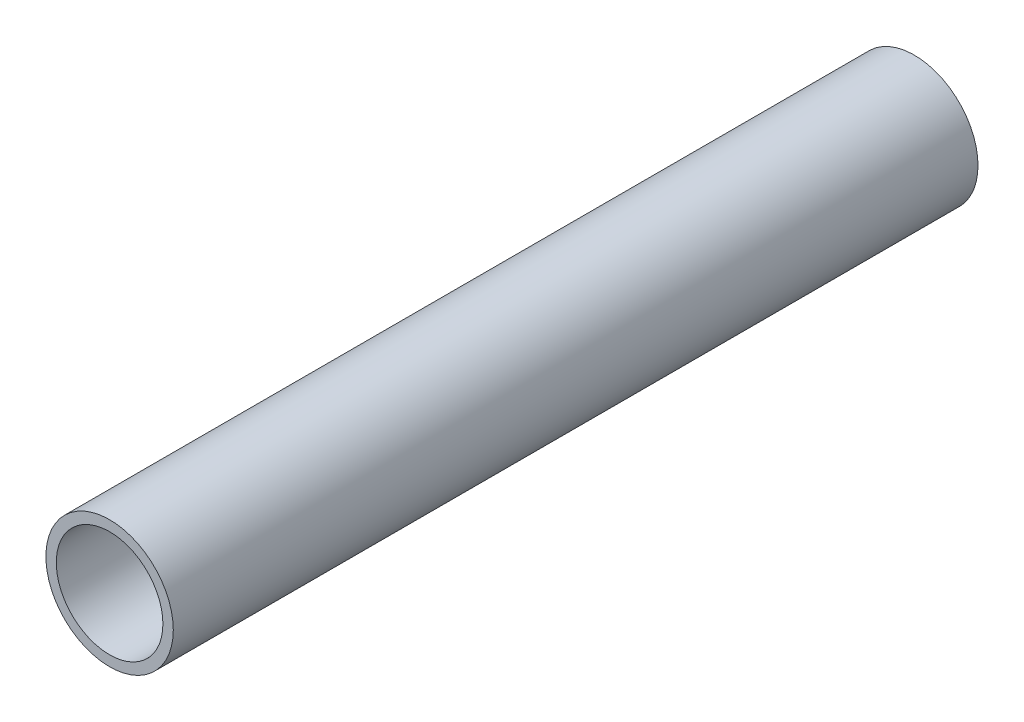
ISO-10303-21;
HEADER;
FILE_DESCRIPTION(('STEP AP214'),'2;1');
FILE_NAME('part.step','',(''),(''),'','','');
FILE_SCHEMA(('AUTOMOTIVE_DESIGN { 1 0 10303 214 1 1 1 1 }'));
ENDSEC;
DATA;
#1=APPLICATION_CONTEXT('core data for automotive mechanical design processes');
#2=APPLICATION_PROTOCOL_DEFINITION('international standard','automotive_design',2000,#1);
#3=PRODUCT_CONTEXT('',#1,'mechanical');
#4=PRODUCT('Part','Part','',(#3));
#5=PRODUCT_RELATED_PRODUCT_CATEGORY('part','',(#4));
#6=PRODUCT_DEFINITION_FORMATION('','',#4);
#7=PRODUCT_DEFINITION_CONTEXT('part definition',#1,'design');
#8=PRODUCT_DEFINITION('design','',#6,#7);
#9=PRODUCT_DEFINITION_SHAPE('','',#8);
#10=(LENGTH_UNIT() NAMED_UNIT(*) SI_UNIT(.MILLI.,.METRE.));
#11=(NAMED_UNIT(*) PLANE_ANGLE_UNIT() SI_UNIT($,.RADIAN.));
#12=(NAMED_UNIT(*) SI_UNIT($,.STERADIAN.) SOLID_ANGLE_UNIT());
#13=UNCERTAINTY_MEASURE_WITH_UNIT(LENGTH_MEASURE(1.E-05),#10,'distance_accuracy_value','');
#14=(GEOMETRIC_REPRESENTATION_CONTEXT(3) GLOBAL_UNCERTAINTY_ASSIGNED_CONTEXT((#13)) GLOBAL_UNIT_ASSIGNED_CONTEXT((#10,
#11,#12)) REPRESENTATION_CONTEXT('',''));
#15=CARTESIAN_POINT('',(0.,0.,0.));
#16=DIRECTION('',(0.,0.,1.));
#17=DIRECTION('',(1.,0.,0.));
#18=AXIS2_PLACEMENT_3D('',#15,#16,#17);
#19=CARTESIAN_POINT('',(0.,0.,304.8));
#20=DIRECTION('',(0.,0.,1.));
#21=DIRECTION('',(1.,0.,0.));
#22=AXIS2_PLACEMENT_3D('',#19,#20,#21);
#23=PLANE('',#22);
#24=CARTESIAN_POINT('',(0.,0.,304.8));
#25=DIRECTION('',(0.,0.,1.));
#26=DIRECTION('',(1.,0.,0.));
#27=AXIS2_PLACEMENT_3D('',#24,#25,#26);
#28=CIRCLE('',#27,24.13);
#29=CARTESIAN_POINT('',(24.13,0.,304.8));
#30=VERTEX_POINT('',#29);
#31=EDGE_CURVE('E10',#30,#30,#28,.T.);
#32=ORIENTED_EDGE('',*,*,#31,.T.);
#33=EDGE_LOOP('',(#32));
#34=FACE_BOUND('',#33,.T.);
#35=CARTESIAN_POINT('',(0.,0.,304.8));
#36=DIRECTION('',(0.,0.,1.));
#37=DIRECTION('',(1.,0.,0.));
#38=AXIS2_PLACEMENT_3D('',#35,#36,#37);
#39=CIRCLE('',#38,20.193);
#40=CARTESIAN_POINT('',(20.193,0.,304.8));
#41=VERTEX_POINT('',#40);
#42=EDGE_CURVE('E42',#41,#41,#39,.T.);
#43=ORIENTED_EDGE('',*,*,#42,.F.);
#44=EDGE_LOOP('',(#43));
#45=FACE_BOUND('',#44,.T.);
#46=ADVANCED_FACE('F31',(#34,#45),#23,.T.);
#47=CARTESIAN_POINT('',(0.,0.,0.));
#48=DIRECTION('',(0.,0.,1.));
#49=DIRECTION('',(1.,0.,0.));
#50=AXIS2_PLACEMENT_3D('',#47,#48,#49);
#51=PLANE('',#50);
#52=CARTESIAN_POINT('',(0.,0.,0.));
#53=DIRECTION('',(0.,0.,1.));
#54=DIRECTION('',(1.,0.,0.));
#55=AXIS2_PLACEMENT_3D('',#52,#53,#54);
#56=CIRCLE('',#55,24.13);
#57=CARTESIAN_POINT('',(24.13,0.,0.));
#58=VERTEX_POINT('',#57);
#59=EDGE_CURVE('E35',#58,#58,#56,.T.);
#60=ORIENTED_EDGE('',*,*,#59,.F.);
#61=EDGE_LOOP('',(#60));
#62=FACE_BOUND('',#61,.T.);
#63=CARTESIAN_POINT('',(0.,0.,0.));
#64=DIRECTION('',(0.,0.,1.));
#65=DIRECTION('',(1.,0.,0.));
#66=AXIS2_PLACEMENT_3D('',#63,#64,#65);
#67=CIRCLE('',#66,20.193);
#68=CARTESIAN_POINT('',(20.193,0.,0.));
#69=VERTEX_POINT('',#68);
#70=EDGE_CURVE('E44',#69,#69,#67,.T.);
#71=ORIENTED_EDGE('',*,*,#70,.T.);
#72=EDGE_LOOP('',(#71));
#73=FACE_BOUND('',#72,.T.);
#74=ADVANCED_FACE('F54',(#62,#73),#51,.F.);
#75=CARTESIAN_POINT('',(0.,0.,304.8));
#76=DIRECTION('',(0.,0.,-1.));
#77=DIRECTION('',(-1.,0.,0.));
#78=AXIS2_PLACEMENT_3D('',#75,#76,#77);
#79=CYLINDRICAL_SURFACE('',#78,24.13);
#80=ORIENTED_EDGE('',*,*,#31,.F.);
#81=EDGE_LOOP('',(#80));
#82=FACE_BOUND('',#81,.T.);
#83=ORIENTED_EDGE('',*,*,#59,.T.);
#84=EDGE_LOOP('',(#83));
#85=FACE_BOUND('',#84,.T.);
#86=ADVANCED_FACE('F33',(#82,#85),#79,.T.);
#87=CARTESIAN_POINT('',(0.,0.,304.8));
#88=DIRECTION('',(0.,0.,-1.));
#89=DIRECTION('',(-1.,0.,0.));
#90=AXIS2_PLACEMENT_3D('',#87,#88,#89);
#91=CYLINDRICAL_SURFACE('',#90,20.193);
#92=ORIENTED_EDGE('',*,*,#42,.T.);
#93=EDGE_LOOP('',(#92));
#94=FACE_BOUND('',#93,.T.);
#95=ORIENTED_EDGE('',*,*,#70,.F.);
#96=EDGE_LOOP('',(#95));
#97=FACE_BOUND('',#96,.T.);
#98=ADVANCED_FACE('F50',(#94,#97),#91,.F.);
#99=CLOSED_SHELL('',(#46,#74,#86,#98));
#100=MANIFOLD_SOLID_BREP('B2',#99);
#101=ADVANCED_BREP_SHAPE_REPRESENTATION('',(#18,#100),#14);
#102=SHAPE_DEFINITION_REPRESENTATION(#9,#101);
ENDSEC;
END-ISO-10303-21;
